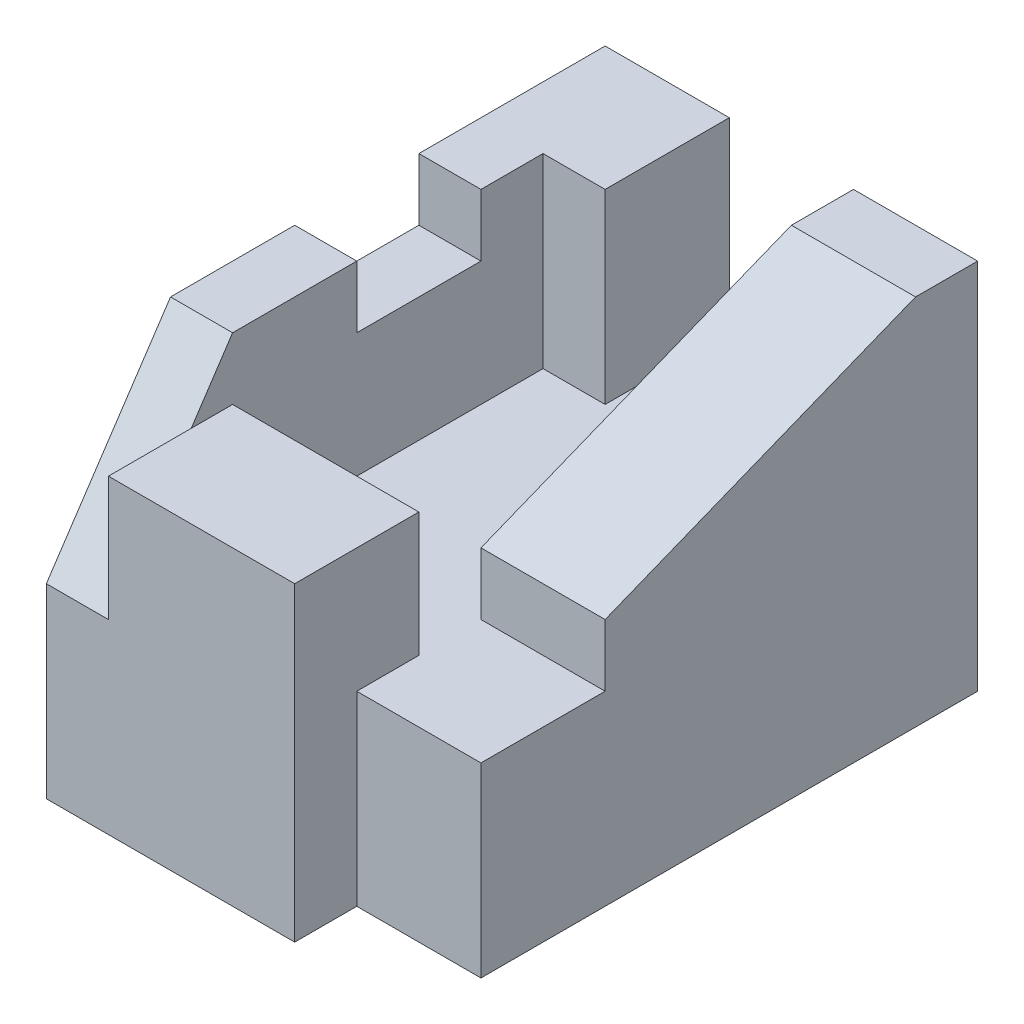
ISO-10303-21;
HEADER;
FILE_DESCRIPTION(('STEP AP214'),'2;1');
FILE_NAME('part.step','',(''),(''),'','','');
FILE_SCHEMA(('AUTOMOTIVE_DESIGN { 1 0 10303 214 1 1 1 1 }'));
ENDSEC;
DATA;
#1=APPLICATION_CONTEXT('core data for automotive mechanical design processes');
#2=APPLICATION_PROTOCOL_DEFINITION('international standard','automotive_design',2000,#1);
#3=PRODUCT_CONTEXT('',#1,'mechanical');
#4=PRODUCT('Part','Part','',(#3));
#5=PRODUCT_RELATED_PRODUCT_CATEGORY('part','',(#4));
#6=PRODUCT_DEFINITION_FORMATION('','',#4);
#7=PRODUCT_DEFINITION_CONTEXT('part definition',#1,'design');
#8=PRODUCT_DEFINITION('design','',#6,#7);
#9=PRODUCT_DEFINITION_SHAPE('','',#8);
#10=(LENGTH_UNIT() NAMED_UNIT(*) SI_UNIT(.MILLI.,.METRE.));
#11=(NAMED_UNIT(*) PLANE_ANGLE_UNIT() SI_UNIT($,.RADIAN.));
#12=(NAMED_UNIT(*) SI_UNIT($,.STERADIAN.) SOLID_ANGLE_UNIT());
#13=UNCERTAINTY_MEASURE_WITH_UNIT(LENGTH_MEASURE(1.E-05),#10,'distance_accuracy_value','');
#14=(GEOMETRIC_REPRESENTATION_CONTEXT(3) GLOBAL_UNCERTAINTY_ASSIGNED_CONTEXT((#13)) GLOBAL_UNIT_ASSIGNED_CONTEXT((#10,
#11,#12)) REPRESENTATION_CONTEXT('',''));
#15=CARTESIAN_POINT('',(0.,0.,0.));
#16=DIRECTION('',(0.,0.,1.));
#17=DIRECTION('',(1.,0.,0.));
#18=AXIS2_PLACEMENT_3D('',#15,#16,#17);
#19=CARTESIAN_POINT('',(0.,0.,9.));
#20=DIRECTION('',(0.,0.,1.));
#21=DIRECTION('',(1.,0.,0.));
#22=AXIS2_PLACEMENT_3D('',#19,#20,#21);
#23=PLANE('',#22);
#24=DIRECTION('',(1.,0.,0.));
#25=VECTOR('',#24,1.);
#26=CARTESIAN_POINT('',(3.,-3.,9.));
#27=LINE('',#26,#25);
#28=CARTESIAN_POINT('',(-3.,-3.,9.));
#29=VERTEX_POINT('',#28);
#30=CARTESIAN_POINT('',(1.,-3.,9.));
#31=VERTEX_POINT('',#30);
#32=EDGE_CURVE('E245',#29,#31,#27,.T.);
#33=ORIENTED_EDGE('',*,*,#32,.T.);
#34=DIRECTION('',(0.,1.,0.));
#35=VECTOR('',#34,1.);
#36=CARTESIAN_POINT('',(1.,0.,9.));
#37=LINE('',#36,#35);
#38=CARTESIAN_POINT('',(1.,2.,9.));
#39=VERTEX_POINT('',#38);
#40=EDGE_CURVE('E226',#31,#39,#37,.T.);
#41=ORIENTED_EDGE('',*,*,#40,.T.);
#42=DIRECTION('',(1.,0.,0.));
#43=VECTOR('',#42,1.);
#44=CARTESIAN_POINT('',(-2.,2.,9.));
#45=LINE('',#44,#43);
#46=CARTESIAN_POINT('',(-2.,2.,9.));
#47=VERTEX_POINT('',#46);
#48=EDGE_CURVE('E342',#47,#39,#45,.T.);
#49=ORIENTED_EDGE('',*,*,#48,.F.);
#50=DIRECTION('',(0.,1.,0.));
#51=VECTOR('',#50,1.);
#52=CARTESIAN_POINT('',(-2.,0.,9.));
#53=LINE('',#52,#51);
#54=CARTESIAN_POINT('',(-2.,0.,9.));
#55=VERTEX_POINT('',#54);
#56=EDGE_CURVE('E330',#55,#47,#53,.T.);
#57=ORIENTED_EDGE('',*,*,#56,.F.);
#58=DIRECTION('',(-1.,0.,0.));
#59=VECTOR('',#58,1.);
#60=CARTESIAN_POINT('',(-2.,0.,9.));
#61=LINE('',#60,#59);
#62=CARTESIAN_POINT('',(-3.,0.,9.));
#63=VERTEX_POINT('',#62);
#64=EDGE_CURVE('E319',#55,#63,#61,.T.);
#65=ORIENTED_EDGE('',*,*,#64,.T.);
#66=DIRECTION('',(0.,-1.,0.));
#67=VECTOR('',#66,1.);
#68=CARTESIAN_POINT('',(-3.,-3.,9.));
#69=LINE('',#68,#67);
#70=EDGE_CURVE('E243',#63,#29,#69,.T.);
#71=ORIENTED_EDGE('',*,*,#70,.T.);
#72=EDGE_LOOP('',(#33,#41,#49,#57,#65,#71));
#73=FACE_BOUND('',#72,.T.);
#74=ADVANCED_FACE('F33',(#73),#23,.T.);
#75=CARTESIAN_POINT('',(3.,3.,9.));
#76=DIRECTION('',(0.,-1.,0.));
#77=DIRECTION('',(1.,0.,0.));
#78=AXIS2_PLACEMENT_3D('',#75,#76,#77);
#79=PLANE('',#78);
#80=DIRECTION('',(0.,0.,-1.));
#81=VECTOR('',#80,1.);
#82=CARTESIAN_POINT('',(-3.,3.,9.));
#83=LINE('',#82,#81);
#84=CARTESIAN_POINT('',(-3.,3.,7.));
#85=VERTEX_POINT('',#84);
#86=CARTESIAN_POINT('',(-3.,3.,5.));
#87=VERTEX_POINT('',#86);
#88=EDGE_CURVE('E259',#85,#87,#83,.T.);
#89=ORIENTED_EDGE('',*,*,#88,.F.);
#90=DIRECTION('',(-1.,0.,0.));
#91=VECTOR('',#90,1.);
#92=CARTESIAN_POINT('',(-2.,3.,7.));
#93=LINE('',#92,#91);
#94=CARTESIAN_POINT('',(-2.,3.,7.));
#95=VERTEX_POINT('',#94);
#96=EDGE_CURVE('E328',#95,#85,#93,.T.);
#97=ORIENTED_EDGE('',*,*,#96,.F.);
#98=DIRECTION('',(0.,0.,1.));
#99=VECTOR('',#98,1.);
#100=CARTESIAN_POINT('',(-2.,3.,2.));
#101=LINE('',#100,#99);
#102=CARTESIAN_POINT('',(-2.,3.,5.));
#103=VERTEX_POINT('',#102);
#104=EDGE_CURVE('E216',#103,#95,#101,.T.);
#105=ORIENTED_EDGE('',*,*,#104,.F.);
#106=DIRECTION('',(1.,0.,0.));
#107=VECTOR('',#106,1.);
#108=CARTESIAN_POINT('',(-3.,3.,5.));
#109=LINE('',#108,#107);
#110=EDGE_CURVE('E314',#87,#103,#109,.T.);
#111=ORIENTED_EDGE('',*,*,#110,.F.);
#112=EDGE_LOOP('',(#89,#97,#105,#111));
#113=FACE_BOUND('',#112,.T.);
#114=ADVANCED_FACE('F374',(#113),#79,.F.);
#115=DIRECTION('',(0.,0.,-1.));
#116=VECTOR('',#115,1.);
#117=CARTESIAN_POINT('',(1.,3.,6.));
#118=LINE('',#117,#116);
#119=CARTESIAN_POINT('',(1.,3.,1.));
#120=VERTEX_POINT('',#119);
#121=CARTESIAN_POINT('',(1.,3.,0.));
#122=VERTEX_POINT('',#121);
#123=EDGE_CURVE('E192',#120,#122,#118,.T.);
#124=ORIENTED_EDGE('',*,*,#123,.F.);
#125=DIRECTION('',(1.,0.,0.));
#126=VECTOR('',#125,1.);
#127=CARTESIAN_POINT('',(1.,3.,1.));
#128=LINE('',#127,#126);
#129=CARTESIAN_POINT('',(3.,3.,1.));
#130=VERTEX_POINT('',#129);
#131=EDGE_CURVE('E178',#120,#130,#128,.T.);
#132=ORIENTED_EDGE('',*,*,#131,.T.);
#133=DIRECTION('',(0.,0.,-1.));
#134=VECTOR('',#133,1.);
#135=CARTESIAN_POINT('',(3.,3.,9.));
#136=LINE('',#135,#134);
#137=CARTESIAN_POINT('',(3.,3.,0.));
#138=VERTEX_POINT('',#137);
#139=EDGE_CURVE('E261',#130,#138,#136,.T.);
#140=ORIENTED_EDGE('',*,*,#139,.T.);
#141=DIRECTION('',(-1.,0.,0.));
#142=VECTOR('',#141,1.);
#143=CARTESIAN_POINT('',(3.,3.,0.));
#144=LINE('',#143,#142);
#145=EDGE_CURVE('E200',#138,#122,#144,.T.);
#146=ORIENTED_EDGE('',*,*,#145,.T.);
#147=EDGE_LOOP('',(#124,#132,#140,#146));
#148=FACE_BOUND('',#147,.T.);
#149=ADVANCED_FACE('F198',(#148),#79,.F.);
#150=CARTESIAN_POINT('',(-3.,-3.,9.));
#151=DIRECTION('',(1.,0.,0.));
#152=DIRECTION('',(0.,0.,-1.));
#153=AXIS2_PLACEMENT_3D('',#150,#151,#152);
#154=PLANE('',#153);
#155=ORIENTED_EDGE('',*,*,#70,.F.);
#156=DIRECTION('',(0.,-0.832050294337844,0.554700196225229));
#157=VECTOR('',#156,1.);
#158=CARTESIAN_POINT('',(-3.,3.,7.));
#159=LINE('',#158,#157);
#160=EDGE_CURVE('E333',#85,#63,#159,.T.);
#161=ORIENTED_EDGE('',*,*,#160,.F.);
#162=ORIENTED_EDGE('',*,*,#88,.T.);
#163=DIRECTION('',(0.,1.,0.));
#164=VECTOR('',#163,1.);
#165=CARTESIAN_POINT('',(-3.,2.,5.));
#166=LINE('',#165,#164);
#167=CARTESIAN_POINT('',(-3.,2.,5.));
#168=VERTEX_POINT('',#167);
#169=EDGE_CURVE('E208',#168,#87,#166,.T.);
#170=ORIENTED_EDGE('',*,*,#169,.F.);
#171=DIRECTION('',(0.,0.,1.));
#172=VECTOR('',#171,1.);
#173=CARTESIAN_POINT('',(-3.,2.,3.));
#174=LINE('',#173,#172);
#175=CARTESIAN_POINT('',(-3.,2.,3.));
#176=VERTEX_POINT('',#175);
#177=EDGE_CURVE('E321',#176,#168,#174,.T.);
#178=ORIENTED_EDGE('',*,*,#177,.F.);
#179=DIRECTION('',(0.,1.,0.));
#180=VECTOR('',#179,1.);
#181=CARTESIAN_POINT('',(-3.,2.,3.));
#182=LINE('',#181,#180);
#183=CARTESIAN_POINT('',(-3.,3.,3.));
#184=VERTEX_POINT('',#183);
#185=EDGE_CURVE('E308',#176,#184,#182,.T.);
#186=ORIENTED_EDGE('',*,*,#185,.T.);
#187=CARTESIAN_POINT('',(-3.,3.,0.));
#188=VERTEX_POINT('',#187);
#189=EDGE_CURVE('E248',#184,#188,#83,.T.);
#190=ORIENTED_EDGE('',*,*,#189,.T.);
#191=DIRECTION('',(0.,-1.,0.));
#192=VECTOR('',#191,1.);
#193=CARTESIAN_POINT('',(-3.,-3.,0.));
#194=LINE('',#193,#192);
#195=CARTESIAN_POINT('',(-3.,-3.,0.));
#196=VERTEX_POINT('',#195);
#197=EDGE_CURVE('E222',#188,#196,#194,.T.);
#198=ORIENTED_EDGE('',*,*,#197,.T.);
#199=DIRECTION('',(0.,0.,-1.));
#200=VECTOR('',#199,1.);
#201=CARTESIAN_POINT('',(-3.,-3.,9.));
#202=LINE('',#201,#200);
#203=EDGE_CURVE('E11',#29,#196,#202,.T.);
#204=ORIENTED_EDGE('',*,*,#203,.F.);
#205=EDGE_LOOP('',(#155,#161,#162,#170,#178,#186,#190,#198,#204));
#206=FACE_BOUND('',#205,.T.);
#207=ADVANCED_FACE('F35',(#206),#154,.F.);
#208=CARTESIAN_POINT('',(3.,-3.,9.));
#209=DIRECTION('',(0.,1.,0.));
#210=DIRECTION('',(-1.,0.,0.));
#211=AXIS2_PLACEMENT_3D('',#208,#209,#210);
#212=PLANE('',#211);
#213=DIRECTION('',(0.,0.,-1.));
#214=VECTOR('',#213,1.);
#215=CARTESIAN_POINT('',(3.,-3.,9.));
#216=LINE('',#215,#214);
#217=CARTESIAN_POINT('',(3.,-3.,8.));
#218=VERTEX_POINT('',#217);
#219=CARTESIAN_POINT('',(3.,-3.,0.));
#220=VERTEX_POINT('',#219);
#221=EDGE_CURVE('E41',#218,#220,#216,.T.);
#222=ORIENTED_EDGE('',*,*,#221,.F.);
#223=DIRECTION('',(1.,0.,0.));
#224=VECTOR('',#223,1.);
#225=CARTESIAN_POINT('',(1.,-3.,8.));
#226=LINE('',#225,#224);
#227=CARTESIAN_POINT('',(1.,-3.,8.));
#228=VERTEX_POINT('',#227);
#229=EDGE_CURVE('E353',#228,#218,#226,.T.);
#230=ORIENTED_EDGE('',*,*,#229,.F.);
#231=DIRECTION('',(0.,0.,-1.));
#232=VECTOR('',#231,1.);
#233=CARTESIAN_POINT('',(1.,-3.,9.));
#234=LINE('',#233,#232);
#235=EDGE_CURVE('E357',#31,#228,#234,.T.);
#236=ORIENTED_EDGE('',*,*,#235,.F.);
#237=ORIENTED_EDGE('',*,*,#32,.F.);
#238=ORIENTED_EDGE('',*,*,#203,.T.);
#239=DIRECTION('',(1.,0.,0.));
#240=VECTOR('',#239,1.);
#241=CARTESIAN_POINT('',(3.,-3.,0.));
#242=LINE('',#241,#240);
#243=EDGE_CURVE('E251',#196,#220,#242,.T.);
#244=ORIENTED_EDGE('',*,*,#243,.T.);
#245=EDGE_LOOP('',(#222,#230,#236,#237,#238,#244));
#246=FACE_BOUND('',#245,.T.);
#247=ADVANCED_FACE('F270',(#246),#212,.F.);
#248=CARTESIAN_POINT('',(3.,-3.,9.));
#249=DIRECTION('',(-1.,0.,0.));
#250=DIRECTION('',(0.,0.,1.));
#251=AXIS2_PLACEMENT_3D('',#248,#249,#250);
#252=PLANE('',#251);
#253=ORIENTED_EDGE('',*,*,#139,.F.);
#254=DIRECTION('',(0.,0.371390676354104,-0.928476690885259));
#255=VECTOR('',#254,1.);
#256=CARTESIAN_POINT('',(3.,3.,1.));
#257=LINE('',#256,#255);
#258=CARTESIAN_POINT('',(3.,1.,6.));
#259=VERTEX_POINT('',#258);
#260=EDGE_CURVE('E181',#259,#130,#257,.T.);
#261=ORIENTED_EDGE('',*,*,#260,.F.);
#262=DIRECTION('',(0.,1.,0.));
#263=VECTOR('',#262,1.);
#264=CARTESIAN_POINT('',(3.,0.,6.));
#265=LINE('',#264,#263);
#266=CARTESIAN_POINT('',(3.,0.,6.));
#267=VERTEX_POINT('',#266);
#268=EDGE_CURVE('E223',#267,#259,#265,.T.);
#269=ORIENTED_EDGE('',*,*,#268,.F.);
#270=DIRECTION('',(0.,0.,-1.));
#271=VECTOR('',#270,1.);
#272=CARTESIAN_POINT('',(3.,0.,9.));
#273=LINE('',#272,#271);
#274=CARTESIAN_POINT('',(3.,0.,8.));
#275=VERTEX_POINT('',#274);
#276=EDGE_CURVE('E286',#275,#267,#273,.T.);
#277=ORIENTED_EDGE('',*,*,#276,.F.);
#278=DIRECTION('',(0.,1.,0.));
#279=VECTOR('',#278,1.);
#280=CARTESIAN_POINT('',(3.,-3.,8.));
#281=LINE('',#280,#279);
#282=EDGE_CURVE('E185',#218,#275,#281,.T.);
#283=ORIENTED_EDGE('',*,*,#282,.F.);
#284=ORIENTED_EDGE('',*,*,#221,.T.);
#285=DIRECTION('',(0.,1.,0.));
#286=VECTOR('',#285,1.);
#287=CARTESIAN_POINT('',(3.,-3.,0.));
#288=LINE('',#287,#286);
#289=EDGE_CURVE('E254',#220,#138,#288,.T.);
#290=ORIENTED_EDGE('',*,*,#289,.T.);
#291=EDGE_LOOP('',(#253,#261,#269,#277,#283,#284,#290));
#292=FACE_BOUND('',#291,.T.);
#293=ADVANCED_FACE('F265',(#292),#252,.F.);
#294=ORIENTED_EDGE('',*,*,#189,.F.);
#295=DIRECTION('',(-1.,0.,0.));
#296=VECTOR('',#295,1.);
#297=CARTESIAN_POINT('',(-2.,3.,3.));
#298=LINE('',#297,#296);
#299=CARTESIAN_POINT('',(-2.,3.,3.));
#300=VERTEX_POINT('',#299);
#301=EDGE_CURVE('E317',#300,#184,#298,.T.);
#302=ORIENTED_EDGE('',*,*,#301,.F.);
#303=CARTESIAN_POINT('',(-2.,3.,2.));
#304=VERTEX_POINT('',#303);
#305=EDGE_CURVE('E217',#304,#300,#101,.T.);
#306=ORIENTED_EDGE('',*,*,#305,.F.);
#307=DIRECTION('',(-1.,0.,0.));
#308=VECTOR('',#307,1.);
#309=CARTESIAN_POINT('',(-1.,3.,2.));
#310=LINE('',#309,#308);
#311=CARTESIAN_POINT('',(-1.,3.,2.));
#312=VERTEX_POINT('',#311);
#313=EDGE_CURVE('E205',#312,#304,#310,.T.);
#314=ORIENTED_EDGE('',*,*,#313,.F.);
#315=DIRECTION('',(0.,0.,1.));
#316=VECTOR('',#315,1.);
#317=CARTESIAN_POINT('',(-1.,3.,0.));
#318=LINE('',#317,#316);
#319=CARTESIAN_POINT('',(-1.,3.,0.));
#320=VERTEX_POINT('',#319);
#321=EDGE_CURVE('E201',#320,#312,#318,.T.);
#322=ORIENTED_EDGE('',*,*,#321,.F.);
#323=EDGE_CURVE('E257',#320,#188,#144,.T.);
#324=ORIENTED_EDGE('',*,*,#323,.T.);
#325=EDGE_LOOP('',(#294,#302,#306,#314,#322,#324));
#326=FACE_BOUND('',#325,.T.);
#327=ADVANCED_FACE('F382',(#326),#79,.F.);
#328=CARTESIAN_POINT('',(0.,0.,0.));
#329=DIRECTION('',(0.,0.,1.));
#330=DIRECTION('',(1.,0.,0.));
#331=AXIS2_PLACEMENT_3D('',#328,#329,#330);
#332=PLANE('',#331);
#333=DIRECTION('',(-1.,0.,0.));
#334=VECTOR('',#333,1.);
#335=CARTESIAN_POINT('',(1.,0.,0.));
#336=LINE('',#335,#334);
#337=CARTESIAN_POINT('',(1.,0.,0.));
#338=VERTEX_POINT('',#337);
#339=CARTESIAN_POINT('',(-1.,0.,0.));
#340=VERTEX_POINT('',#339);
#341=EDGE_CURVE('E279',#338,#340,#336,.T.);
#342=ORIENTED_EDGE('',*,*,#341,.F.);
#343=DIRECTION('',(0.,1.,0.));
#344=VECTOR('',#343,1.);
#345=CARTESIAN_POINT('',(1.,0.,0.));
#346=LINE('',#345,#344);
#347=EDGE_CURVE('E241',#338,#122,#346,.T.);
#348=ORIENTED_EDGE('',*,*,#347,.T.);
#349=ORIENTED_EDGE('',*,*,#145,.F.);
#350=ORIENTED_EDGE('',*,*,#289,.F.);
#351=ORIENTED_EDGE('',*,*,#243,.F.);
#352=ORIENTED_EDGE('',*,*,#197,.F.);
#353=ORIENTED_EDGE('',*,*,#323,.F.);
#354=DIRECTION('',(0.,1.,0.));
#355=VECTOR('',#354,1.);
#356=CARTESIAN_POINT('',(-1.,0.,0.));
#357=LINE('',#356,#355);
#358=EDGE_CURVE('E239',#340,#320,#357,.T.);
#359=ORIENTED_EDGE('',*,*,#358,.F.);
#360=EDGE_LOOP('',(#342,#348,#349,#350,#351,#352,#353,#359));
#361=FACE_BOUND('',#360,.T.);
#362=ADVANCED_FACE('F276',(#361),#332,.F.);
#363=CARTESIAN_POINT('',(1.,0.,6.));
#364=DIRECTION('',(1.,0.,0.));
#365=DIRECTION('',(0.,1.,0.));
#366=AXIS2_PLACEMENT_3D('',#363,#364,#365);
#367=PLANE('',#366);
#368=DIRECTION('',(0.,1.,0.));
#369=VECTOR('',#368,1.);
#370=CARTESIAN_POINT('',(1.,0.,6.));
#371=LINE('',#370,#369);
#372=CARTESIAN_POINT('',(1.,0.,6.));
#373=VERTEX_POINT('',#372);
#374=CARTESIAN_POINT('',(1.,1.,6.));
#375=VERTEX_POINT('',#374);
#376=EDGE_CURVE('E195',#373,#375,#371,.T.);
#377=ORIENTED_EDGE('',*,*,#376,.T.);
#378=DIRECTION('',(0.,0.371390676354104,-0.928476690885259));
#379=VECTOR('',#378,1.);
#380=CARTESIAN_POINT('',(1.,3.,1.));
#381=LINE('',#380,#379);
#382=EDGE_CURVE('E48',#375,#120,#381,.T.);
#383=ORIENTED_EDGE('',*,*,#382,.T.);
#384=ORIENTED_EDGE('',*,*,#123,.T.);
#385=ORIENTED_EDGE('',*,*,#347,.F.);
#386=DIRECTION('',(0.,0.,-1.));
#387=VECTOR('',#386,1.);
#388=CARTESIAN_POINT('',(1.,0.,6.));
#389=LINE('',#388,#387);
#390=EDGE_CURVE('E220',#373,#338,#389,.T.);
#391=ORIENTED_EDGE('',*,*,#390,.F.);
#392=EDGE_LOOP('',(#377,#383,#384,#385,#391));
#393=FACE_BOUND('',#392,.T.);
#394=ADVANCED_FACE('F190',(#393),#367,.F.);
#395=CARTESIAN_POINT('',(3.,0.,6.));
#396=DIRECTION('',(0.,0.,-1.));
#397=DIRECTION('',(-1.,0.,0.));
#398=AXIS2_PLACEMENT_3D('',#395,#396,#397);
#399=PLANE('',#398);
#400=ORIENTED_EDGE('',*,*,#268,.T.);
#401=DIRECTION('',(1.,0.,0.));
#402=VECTOR('',#401,1.);
#403=CARTESIAN_POINT('',(1.,1.,6.));
#404=LINE('',#403,#402);
#405=EDGE_CURVE('E186',#375,#259,#404,.T.);
#406=ORIENTED_EDGE('',*,*,#405,.F.);
#407=ORIENTED_EDGE('',*,*,#376,.F.);
#408=DIRECTION('',(-1.,0.,0.));
#409=VECTOR('',#408,1.);
#410=CARTESIAN_POINT('',(3.,0.,6.));
#411=LINE('',#410,#409);
#412=EDGE_CURVE('E211',#267,#373,#411,.T.);
#413=ORIENTED_EDGE('',*,*,#412,.F.);
#414=EDGE_LOOP('',(#400,#406,#407,#413));
#415=FACE_BOUND('',#414,.T.);
#416=ADVANCED_FACE('F361',(#415),#399,.F.);
#417=CARTESIAN_POINT('',(1.,0.,7.));
#418=DIRECTION('',(-1.,0.,0.));
#419=DIRECTION('',(0.,0.,1.));
#420=AXIS2_PLACEMENT_3D('',#417,#418,#419);
#421=PLANE('',#420);
#422=DIRECTION('',(0.,1.,0.));
#423=VECTOR('',#422,1.);
#424=CARTESIAN_POINT('',(1.,0.,7.));
#425=LINE('',#424,#423);
#426=CARTESIAN_POINT('',(1.,0.,7.));
#427=VERTEX_POINT('',#426);
#428=CARTESIAN_POINT('',(1.,2.,7.));
#429=VERTEX_POINT('',#428);
#430=EDGE_CURVE('E229',#427,#429,#425,.T.);
#431=ORIENTED_EDGE('',*,*,#430,.T.);
#432=DIRECTION('',(0.,0.,-1.));
#433=VECTOR('',#432,1.);
#434=CARTESIAN_POINT('',(1.,2.,7.));
#435=LINE('',#434,#433);
#436=EDGE_CURVE('E347',#39,#429,#435,.T.);
#437=ORIENTED_EDGE('',*,*,#436,.F.);
#438=ORIENTED_EDGE('',*,*,#40,.F.);
#439=ORIENTED_EDGE('',*,*,#235,.T.);
#440=DIRECTION('',(0.,1.,0.));
#441=VECTOR('',#440,1.);
#442=CARTESIAN_POINT('',(1.,-3.,8.));
#443=LINE('',#442,#441);
#444=CARTESIAN_POINT('',(1.,0.,8.));
#445=VERTEX_POINT('',#444);
#446=EDGE_CURVE('E56',#228,#445,#443,.T.);
#447=ORIENTED_EDGE('',*,*,#446,.T.);
#448=DIRECTION('',(0.,0.,1.));
#449=VECTOR('',#448,1.);
#450=CARTESIAN_POINT('',(1.,0.,7.));
#451=LINE('',#450,#449);
#452=EDGE_CURVE('E289',#427,#445,#451,.T.);
#453=ORIENTED_EDGE('',*,*,#452,.F.);
#454=EDGE_LOOP('',(#431,#437,#438,#439,#447,#453));
#455=FACE_BOUND('',#454,.T.);
#456=ADVANCED_FACE('F363',(#455),#421,.F.);
#457=CARTESIAN_POINT('',(-2.,0.,7.));
#458=DIRECTION('',(0.,0.,1.));
#459=DIRECTION('',(1.,0.,0.));
#460=AXIS2_PLACEMENT_3D('',#457,#458,#459);
#461=PLANE('',#460);
#462=DIRECTION('',(0.,1.,0.));
#463=VECTOR('',#462,1.);
#464=CARTESIAN_POINT('',(-2.,0.,7.));
#465=LINE('',#464,#463);
#466=CARTESIAN_POINT('',(-2.,0.,7.));
#467=VERTEX_POINT('',#466);
#468=CARTESIAN_POINT('',(-2.,2.,7.));
#469=VERTEX_POINT('',#468);
#470=EDGE_CURVE('E232',#467,#469,#465,.T.);
#471=ORIENTED_EDGE('',*,*,#470,.T.);
#472=DIRECTION('',(1.,0.,0.));
#473=VECTOR('',#472,1.);
#474=CARTESIAN_POINT('',(-2.,2.,7.));
#475=LINE('',#474,#473);
#476=EDGE_CURVE('E336',#469,#429,#475,.T.);
#477=ORIENTED_EDGE('',*,*,#476,.T.);
#478=ORIENTED_EDGE('',*,*,#430,.F.);
#479=DIRECTION('',(1.,0.,0.));
#480=VECTOR('',#479,1.);
#481=CARTESIAN_POINT('',(-2.,0.,7.));
#482=LINE('',#481,#480);
#483=EDGE_CURVE('E291',#467,#427,#482,.T.);
#484=ORIENTED_EDGE('',*,*,#483,.F.);
#485=EDGE_LOOP('',(#471,#477,#478,#484));
#486=FACE_BOUND('',#485,.T.);
#487=ADVANCED_FACE('F369',(#486),#461,.F.);
#488=CARTESIAN_POINT('',(-2.,0.,2.));
#489=DIRECTION('',(-1.,0.,0.));
#490=DIRECTION('',(0.,-1.,0.));
#491=AXIS2_PLACEMENT_3D('',#488,#489,#490);
#492=PLANE('',#491);
#493=DIRECTION('',(0.,0.,-1.));
#494=VECTOR('',#493,1.);
#495=CARTESIAN_POINT('',(-2.,2.,5.));
#496=LINE('',#495,#494);
#497=CARTESIAN_POINT('',(-2.,2.,5.));
#498=VERTEX_POINT('',#497);
#499=CARTESIAN_POINT('',(-2.,2.,3.));
#500=VERTEX_POINT('',#499);
#501=EDGE_CURVE('E316',#498,#500,#496,.T.);
#502=ORIENTED_EDGE('',*,*,#501,.F.);
#503=DIRECTION('',(0.,1.,0.));
#504=VECTOR('',#503,1.);
#505=CARTESIAN_POINT('',(-2.,2.,5.));
#506=LINE('',#505,#504);
#507=EDGE_CURVE('E202',#498,#103,#506,.T.);
#508=ORIENTED_EDGE('',*,*,#507,.T.);
#509=ORIENTED_EDGE('',*,*,#104,.T.);
#510=DIRECTION('',(0.,-0.832050294337844,0.554700196225229));
#511=VECTOR('',#510,1.);
#512=CARTESIAN_POINT('',(-2.,3.,7.));
#513=LINE('',#512,#511);
#514=CARTESIAN_POINT('',(-2.,2.,7.66666666666667));
#515=VERTEX_POINT('',#514);
#516=EDGE_CURVE('E339',#95,#515,#513,.T.);
#517=ORIENTED_EDGE('',*,*,#516,.T.);
#518=DIRECTION('',(0.,0.,-1.));
#519=VECTOR('',#518,1.);
#520=CARTESIAN_POINT('',(-2.,2.,7.));
#521=LINE('',#520,#519);
#522=EDGE_CURVE('E349',#515,#469,#521,.T.);
#523=ORIENTED_EDGE('',*,*,#522,.T.);
#524=ORIENTED_EDGE('',*,*,#470,.F.);
#525=DIRECTION('',(0.,0.,1.));
#526=VECTOR('',#525,1.);
#527=CARTESIAN_POINT('',(-2.,0.,2.));
#528=LINE('',#527,#526);
#529=CARTESIAN_POINT('',(-2.,0.,2.));
#530=VERTEX_POINT('',#529);
#531=EDGE_CURVE('E296',#530,#467,#528,.T.);
#532=ORIENTED_EDGE('',*,*,#531,.F.);
#533=DIRECTION('',(0.,1.,0.));
#534=VECTOR('',#533,1.);
#535=CARTESIAN_POINT('',(-2.,0.,2.));
#536=LINE('',#535,#534);
#537=EDGE_CURVE('E235',#530,#304,#536,.T.);
#538=ORIENTED_EDGE('',*,*,#537,.T.);
#539=ORIENTED_EDGE('',*,*,#305,.T.);
#540=DIRECTION('',(0.,1.,0.));
#541=VECTOR('',#540,1.);
#542=CARTESIAN_POINT('',(-2.,2.,3.));
#543=LINE('',#542,#541);
#544=EDGE_CURVE('E306',#500,#300,#543,.T.);
#545=ORIENTED_EDGE('',*,*,#544,.F.);
#546=EDGE_LOOP('',(#502,#508,#509,#517,#523,#524,#532,#538,#539,#545));
#547=FACE_BOUND('',#546,.T.);
#548=ADVANCED_FACE('F418',(#547),#492,.F.);
#549=CARTESIAN_POINT('',(-0.999999999999999,0.,2.));
#550=DIRECTION('',(0.,0.,-1.));
#551=DIRECTION('',(-1.,0.,0.));
#552=AXIS2_PLACEMENT_3D('',#549,#550,#551);
#553=PLANE('',#552);
#554=ORIENTED_EDGE('',*,*,#313,.T.);
#555=ORIENTED_EDGE('',*,*,#537,.F.);
#556=DIRECTION('',(-1.,0.,0.));
#557=VECTOR('',#556,1.);
#558=CARTESIAN_POINT('',(-0.999999999999999,0.,2.));
#559=LINE('',#558,#557);
#560=CARTESIAN_POINT('',(-0.999999999999999,0.,2.));
#561=VERTEX_POINT('',#560);
#562=EDGE_CURVE('E299',#561,#530,#559,.T.);
#563=ORIENTED_EDGE('',*,*,#562,.F.);
#564=DIRECTION('',(0.,1.,0.));
#565=VECTOR('',#564,1.);
#566=CARTESIAN_POINT('',(-0.999999999999999,0.,2.));
#567=LINE('',#566,#565);
#568=EDGE_CURVE('E237',#561,#312,#567,.T.);
#569=ORIENTED_EDGE('',*,*,#568,.T.);
#570=EDGE_LOOP('',(#554,#555,#563,#569));
#571=FACE_BOUND('',#570,.T.);
#572=ADVANCED_FACE('F438',(#571),#553,.F.);
#573=CARTESIAN_POINT('',(-1.,0.,0.));
#574=DIRECTION('',(-1.,0.,0.));
#575=DIRECTION('',(0.,-1.,0.));
#576=AXIS2_PLACEMENT_3D('',#573,#574,#575);
#577=PLANE('',#576);
#578=ORIENTED_EDGE('',*,*,#321,.T.);
#579=ORIENTED_EDGE('',*,*,#568,.F.);
#580=DIRECTION('',(0.,0.,1.));
#581=VECTOR('',#580,1.);
#582=CARTESIAN_POINT('',(-1.,0.,0.));
#583=LINE('',#582,#581);
#584=EDGE_CURVE('E302',#340,#561,#583,.T.);
#585=ORIENTED_EDGE('',*,*,#584,.F.);
#586=ORIENTED_EDGE('',*,*,#358,.T.);
#587=EDGE_LOOP('',(#578,#579,#585,#586));
#588=FACE_BOUND('',#587,.T.);
#589=ADVANCED_FACE('F442',(#588),#577,.F.);
#590=CARTESIAN_POINT('',(0.,0.,0.));
#591=DIRECTION('',(0.,1.,0.));
#592=DIRECTION('',(0.,0.,1.));
#593=AXIS2_PLACEMENT_3D('',#590,#591,#592);
#594=PLANE('',#593);
#595=DIRECTION('',(1.,0.,0.));
#596=VECTOR('',#595,1.);
#597=CARTESIAN_POINT('',(1.,0.,8.));
#598=LINE('',#597,#596);
#599=EDGE_CURVE('E350',#445,#275,#598,.T.);
#600=ORIENTED_EDGE('',*,*,#599,.T.);
#601=ORIENTED_EDGE('',*,*,#276,.T.);
#602=ORIENTED_EDGE('',*,*,#412,.T.);
#603=ORIENTED_EDGE('',*,*,#390,.T.);
#604=ORIENTED_EDGE('',*,*,#341,.T.);
#605=ORIENTED_EDGE('',*,*,#584,.T.);
#606=ORIENTED_EDGE('',*,*,#562,.T.);
#607=ORIENTED_EDGE('',*,*,#531,.T.);
#608=ORIENTED_EDGE('',*,*,#483,.T.);
#609=ORIENTED_EDGE('',*,*,#452,.T.);
#610=EDGE_LOOP('',(#600,#601,#602,#603,#604,#605,#606,#607,#608,#609));
#611=FACE_BOUND('',#610,.T.);
#612=ADVANCED_FACE('F285',(#611),#594,.T.);
#613=CARTESIAN_POINT('',(-3.,2.,5.));
#614=DIRECTION('',(0.,0.,1.));
#615=DIRECTION('',(1.,0.,0.));
#616=AXIS2_PLACEMENT_3D('',#613,#614,#615);
#617=PLANE('',#616);
#618=ORIENTED_EDGE('',*,*,#110,.T.);
#619=ORIENTED_EDGE('',*,*,#507,.F.);
#620=DIRECTION('',(1.,0.,0.));
#621=VECTOR('',#620,1.);
#622=CARTESIAN_POINT('',(-3.,2.,5.));
#623=LINE('',#622,#621);
#624=EDGE_CURVE('E309',#168,#498,#623,.T.);
#625=ORIENTED_EDGE('',*,*,#624,.F.);
#626=ORIENTED_EDGE('',*,*,#169,.T.);
#627=EDGE_LOOP('',(#618,#619,#625,#626));
#628=FACE_BOUND('',#627,.T.);
#629=ADVANCED_FACE('F423',(#628),#617,.F.);
#630=CARTESIAN_POINT('',(-2.,2.,3.));
#631=DIRECTION('',(0.,0.,-1.));
#632=DIRECTION('',(-1.,0.,0.));
#633=AXIS2_PLACEMENT_3D('',#630,#631,#632);
#634=PLANE('',#633);
#635=ORIENTED_EDGE('',*,*,#301,.T.);
#636=ORIENTED_EDGE('',*,*,#185,.F.);
#637=DIRECTION('',(-1.,0.,0.));
#638=VECTOR('',#637,1.);
#639=CARTESIAN_POINT('',(-2.,2.,3.));
#640=LINE('',#639,#638);
#641=EDGE_CURVE('E323',#500,#176,#640,.T.);
#642=ORIENTED_EDGE('',*,*,#641,.F.);
#643=ORIENTED_EDGE('',*,*,#544,.T.);
#644=EDGE_LOOP('',(#635,#636,#642,#643));
#645=FACE_BOUND('',#644,.T.);
#646=ADVANCED_FACE('F430',(#645),#634,.F.);
#647=CARTESIAN_POINT('',(0.,2.,0.));
#648=DIRECTION('',(0.,1.,0.));
#649=DIRECTION('',(0.,0.,1.));
#650=AXIS2_PLACEMENT_3D('',#647,#648,#649);
#651=PLANE('',#650);
#652=ORIENTED_EDGE('',*,*,#501,.T.);
#653=ORIENTED_EDGE('',*,*,#641,.T.);
#654=ORIENTED_EDGE('',*,*,#177,.T.);
#655=ORIENTED_EDGE('',*,*,#624,.T.);
#656=EDGE_LOOP('',(#652,#653,#654,#655));
#657=FACE_BOUND('',#656,.T.);
#658=ADVANCED_FACE('F428',(#657),#651,.T.);
#659=CARTESIAN_POINT('',(-2.,3.,7.));
#660=DIRECTION('',(0.,-0.554700196225229,-0.832050294337844));
#661=DIRECTION('',(0.,0.832050294337844,-0.554700196225229));
#662=AXIS2_PLACEMENT_3D('',#659,#660,#661);
#663=PLANE('',#662);
#664=ORIENTED_EDGE('',*,*,#160,.T.);
#665=ORIENTED_EDGE('',*,*,#64,.F.);
#666=EDGE_CURVE('E335',#515,#55,#513,.T.);
#667=ORIENTED_EDGE('',*,*,#666,.F.);
#668=ORIENTED_EDGE('',*,*,#516,.F.);
#669=ORIENTED_EDGE('',*,*,#96,.T.);
#670=EDGE_LOOP('',(#664,#665,#667,#668,#669));
#671=FACE_BOUND('',#670,.T.);
#672=ADVANCED_FACE('F411',(#671),#663,.F.);
#673=CARTESIAN_POINT('',(-2.,0.,0.));
#674=DIRECTION('',(1.,0.,0.));
#675=DIRECTION('',(0.,0.,-1.));
#676=AXIS2_PLACEMENT_3D('',#673,#674,#675);
#677=PLANE('',#676);
#678=ORIENTED_EDGE('',*,*,#56,.T.);
#679=EDGE_CURVE('E344',#47,#515,#521,.T.);
#680=ORIENTED_EDGE('',*,*,#679,.T.);
#681=ORIENTED_EDGE('',*,*,#666,.T.);
#682=EDGE_LOOP('',(#678,#680,#681));
#683=FACE_BOUND('',#682,.T.);
#684=ADVANCED_FACE('F408',(#683),#677,.F.);
#685=CARTESIAN_POINT('',(-2.,2.,7.));
#686=DIRECTION('',(0.,-1.,0.));
#687=DIRECTION('',(0.,0.,-1.));
#688=AXIS2_PLACEMENT_3D('',#685,#686,#687);
#689=PLANE('',#688);
#690=ORIENTED_EDGE('',*,*,#436,.T.);
#691=ORIENTED_EDGE('',*,*,#476,.F.);
#692=ORIENTED_EDGE('',*,*,#522,.F.);
#693=ORIENTED_EDGE('',*,*,#679,.F.);
#694=ORIENTED_EDGE('',*,*,#48,.T.);
#695=EDGE_LOOP('',(#690,#691,#692,#693,#694));
#696=FACE_BOUND('',#695,.T.);
#697=ADVANCED_FACE('F446',(#696),#689,.F.);
#698=CARTESIAN_POINT('',(1.,-3.,8.));
#699=DIRECTION('',(0.,0.,-1.));
#700=DIRECTION('',(-1.,0.,0.));
#701=AXIS2_PLACEMENT_3D('',#698,#699,#700);
#702=PLANE('',#701);
#703=ORIENTED_EDGE('',*,*,#282,.T.);
#704=ORIENTED_EDGE('',*,*,#599,.F.);
#705=ORIENTED_EDGE('',*,*,#446,.F.);
#706=ORIENTED_EDGE('',*,*,#229,.T.);
#707=EDGE_LOOP('',(#703,#704,#705,#706));
#708=FACE_BOUND('',#707,.T.);
#709=ADVANCED_FACE('F448',(#708),#702,.F.);
#710=CARTESIAN_POINT('',(1.,3.,1.));
#711=DIRECTION('',(0.,-0.928476690885259,-0.371390676354104));
#712=DIRECTION('',(0.,0.371390676354104,-0.928476690885259));
#713=AXIS2_PLACEMENT_3D('',#710,#711,#712);
#714=PLANE('',#713);
#715=ORIENTED_EDGE('',*,*,#260,.T.);
#716=ORIENTED_EDGE('',*,*,#131,.F.);
#717=ORIENTED_EDGE('',*,*,#382,.F.);
#718=ORIENTED_EDGE('',*,*,#405,.T.);
#719=EDGE_LOOP('',(#715,#716,#717,#718));
#720=FACE_BOUND('',#719,.T.);
#721=ADVANCED_FACE('F179',(#720),#714,.F.);
#722=CLOSED_SHELL('',(#74,#114,#149,#207,#247,#293,#327,#362,#394,#416,#456,#487,#548,#572,#589,
#612,#629,#646,#658,#672,#684,#697,#709,#721));
#723=MANIFOLD_SOLID_BREP('B2',#722);
#724=ADVANCED_BREP_SHAPE_REPRESENTATION('',(#18,#723),#14);
#725=SHAPE_DEFINITION_REPRESENTATION(#9,#724);
ENDSEC;
END-ISO-10303-21;
